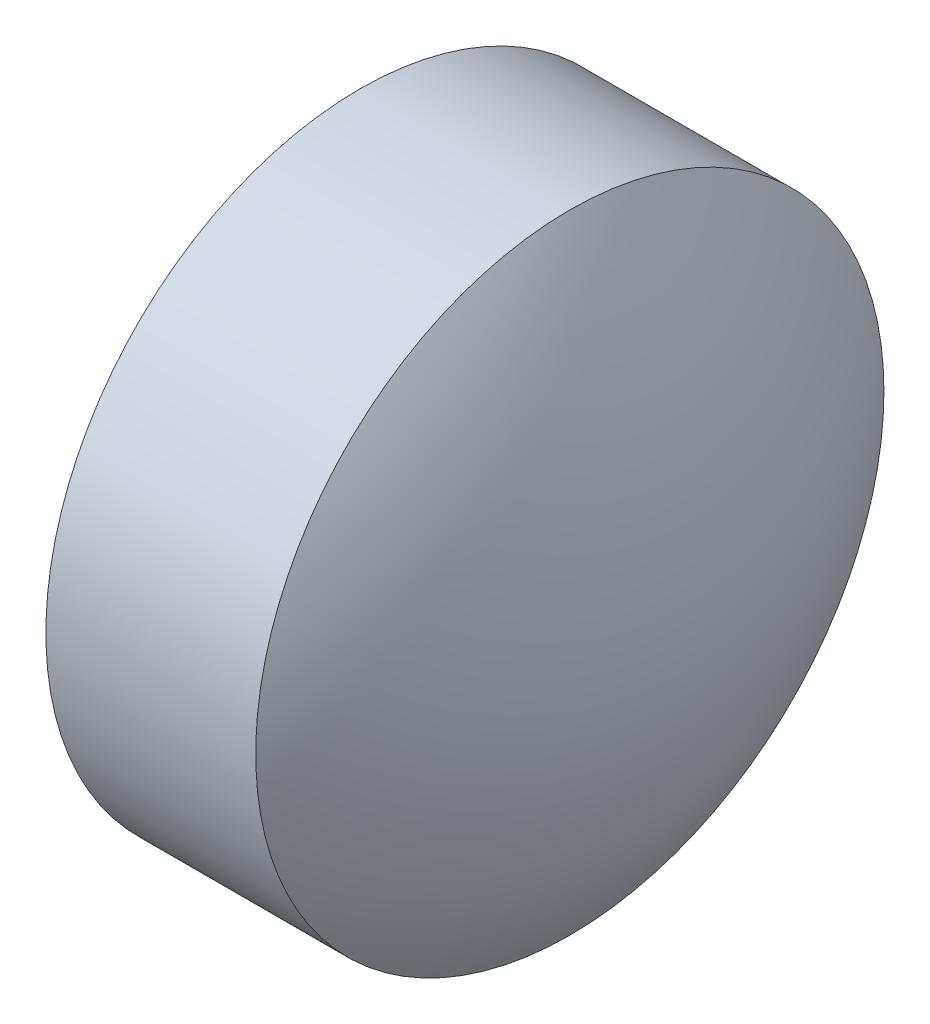
ISO-10303-21;
HEADER;
FILE_DESCRIPTION(('STEP AP214'),'2;1');
FILE_NAME('part.step','',(''),(''),'','','');
FILE_SCHEMA(('AUTOMOTIVE_DESIGN { 1 0 10303 214 1 1 1 1 }'));
ENDSEC;
DATA;
#1=APPLICATION_CONTEXT('core data for automotive mechanical design processes');
#2=APPLICATION_PROTOCOL_DEFINITION('international standard','automotive_design',2000,#1);
#3=PRODUCT_CONTEXT('',#1,'mechanical');
#4=PRODUCT('Part','Part','',(#3));
#5=PRODUCT_RELATED_PRODUCT_CATEGORY('part','',(#4));
#6=PRODUCT_DEFINITION_FORMATION('','',#4);
#7=PRODUCT_DEFINITION_CONTEXT('part definition',#1,'design');
#8=PRODUCT_DEFINITION('design','',#6,#7);
#9=PRODUCT_DEFINITION_SHAPE('','',#8);
#10=(LENGTH_UNIT() NAMED_UNIT(*) SI_UNIT(.MILLI.,.METRE.));
#11=(NAMED_UNIT(*) PLANE_ANGLE_UNIT() SI_UNIT($,.RADIAN.));
#12=(NAMED_UNIT(*) SI_UNIT($,.STERADIAN.) SOLID_ANGLE_UNIT());
#13=UNCERTAINTY_MEASURE_WITH_UNIT(LENGTH_MEASURE(1.E-05),#10,'distance_accuracy_value','');
#14=(GEOMETRIC_REPRESENTATION_CONTEXT(3) GLOBAL_UNCERTAINTY_ASSIGNED_CONTEXT((#13)) GLOBAL_UNIT_ASSIGNED_CONTEXT((#10,
#11,#12)) REPRESENTATION_CONTEXT('',''));
#15=CARTESIAN_POINT('',(0.,0.,0.));
#16=DIRECTION('',(0.,0.,1.));
#17=DIRECTION('',(1.,0.,0.));
#18=AXIS2_PLACEMENT_3D('',#15,#16,#17);
#19=CARTESIAN_POINT('',(-1.78,0.,0.));
#20=DIRECTION('',(1.,0.,0.));
#21=DIRECTION('',(0.,1.,0.));
#22=AXIS2_PLACEMENT_3D('',#19,#20,#21);
#23=CYLINDRICAL_SURFACE('',#22,1.5);
#24=CARTESIAN_POINT('',(-1.27901337136756,0.,0.));
#25=DIRECTION('',(1.,0.,0.));
#26=DIRECTION('',(0.,0.,-1.));
#27=AXIS2_PLACEMENT_3D('',#24,#25,#26);
#28=CIRCLE('',#27,1.5);
#29=CARTESIAN_POINT('',(-1.27901337136756,1.5,0.));
#30=VERTEX_POINT('',#29);
#31=CARTESIAN_POINT('',(-1.27901337136755,-1.5,0.));
#32=VERTEX_POINT('',#31);
#33=EDGE_CURVE('E54',#30,#32,#28,.T.);
#34=ORIENTED_EDGE('',*,*,#33,.F.);
#35=CARTESIAN_POINT('',(-1.27901337136756,0.,0.));
#36=DIRECTION('',(1.,0.,0.));
#37=DIRECTION('',(0.,0.,-1.));
#38=AXIS2_PLACEMENT_3D('',#35,#36,#37);
#39=CIRCLE('',#38,1.5);
#40=EDGE_CURVE('E51',#32,#30,#39,.T.);
#41=ORIENTED_EDGE('',*,*,#40,.F.);
#42=DIRECTION('',(-1.,0.,0.));
#43=VECTOR('',#42,1.);
#44=CARTESIAN_POINT('',(-1.78,-1.5,0.));
#45=LINE('',#44,#43);
#46=CARTESIAN_POINT('',(-2.28098662863244,-1.5,0.));
#47=VERTEX_POINT('',#46);
#48=EDGE_CURVE('E10',#32,#47,#45,.T.);
#49=ORIENTED_EDGE('',*,*,#48,.T.);
#50=CARTESIAN_POINT('',(-2.28098662863244,0.,0.));
#51=DIRECTION('',(1.,0.,0.));
#52=DIRECTION('',(0.,0.,-1.));
#53=AXIS2_PLACEMENT_3D('',#50,#51,#52);
#54=CIRCLE('',#53,1.5);
#55=CARTESIAN_POINT('',(-2.28098662863244,1.5,0.));
#56=VERTEX_POINT('',#55);
#57=EDGE_CURVE('E24',#47,#56,#54,.T.);
#58=ORIENTED_EDGE('',*,*,#57,.T.);
#59=CARTESIAN_POINT('',(-2.28098662863244,0.,0.));
#60=DIRECTION('',(1.,0.,0.));
#61=DIRECTION('',(0.,0.,-1.));
#62=AXIS2_PLACEMENT_3D('',#59,#60,#61);
#63=CIRCLE('',#62,1.5);
#64=EDGE_CURVE('E18',#56,#47,#63,.T.);
#65=ORIENTED_EDGE('',*,*,#64,.T.);
#66=ORIENTED_EDGE('',*,*,#48,.F.);
#67=EDGE_LOOP('',(#34,#41,#49,#58,#65,#66));
#68=FACE_BOUND('',#67,.T.);
#69=ADVANCED_FACE('F15',(#68),#23,.T.);
#70=CARTESIAN_POINT('',(0.,0.,0.));
#71=DIRECTION('',(0.,0.,1.));
#72=DIRECTION('',(-0.999548194892402,-0.0300567145134289,0.));
#73=AXIS2_PLACEMENT_3D('',#70,#71,#72);
#74=SPHERICAL_SURFACE('',#73,2.73);
#75=CARTESIAN_POINT('',(0.,0.,0.));
#76=DIRECTION('',(1.,0.,0.));
#77=DIRECTION('',(0.,0.,-1.));
#78=AXIS2_PLACEMENT_3D('',#75,#76,#77);
#79=SPHERICAL_SURFACE('',#78,2.73);
#80=ORIENTED_EDGE('',*,*,#64,.F.);
#81=ORIENTED_EDGE('',*,*,#57,.F.);
#82=EDGE_LOOP('',(#80,#81));
#83=FACE_BOUND('',#82,.T.);
#84=ADVANCED_FACE('F69',(#83),#79,.T.);
#85=CARTESIAN_POINT('',(-3.56,0.,0.));
#86=DIRECTION('',(0.,0.,1.));
#87=DIRECTION('',(1.,0.,0.));
#88=AXIS2_PLACEMENT_3D('',#85,#86,#87);
#89=SPHERICAL_SURFACE('',#88,2.73);
#90=CARTESIAN_POINT('',(-3.56,0.,0.));
#91=DIRECTION('',(1.,0.,0.));
#92=DIRECTION('',(0.,0.,-1.));
#93=AXIS2_PLACEMENT_3D('',#90,#91,#92);
#94=SPHERICAL_SURFACE('',#93,2.73);
#95=ORIENTED_EDGE('',*,*,#33,.T.);
#96=ORIENTED_EDGE('',*,*,#40,.T.);
#97=EDGE_LOOP('',(#95,#96));
#98=FACE_BOUND('',#97,.T.);
#99=ADVANCED_FACE('F53',(#98),#94,.T.);
#100=CLOSED_SHELL('',(#69,#84,#99));
#101=MANIFOLD_SOLID_BREP('B1',#100);
#102=ADVANCED_BREP_SHAPE_REPRESENTATION('',(#18,#101),#14);
#103=SHAPE_DEFINITION_REPRESENTATION(#9,#102);
ENDSEC;
END-ISO-10303-21;
